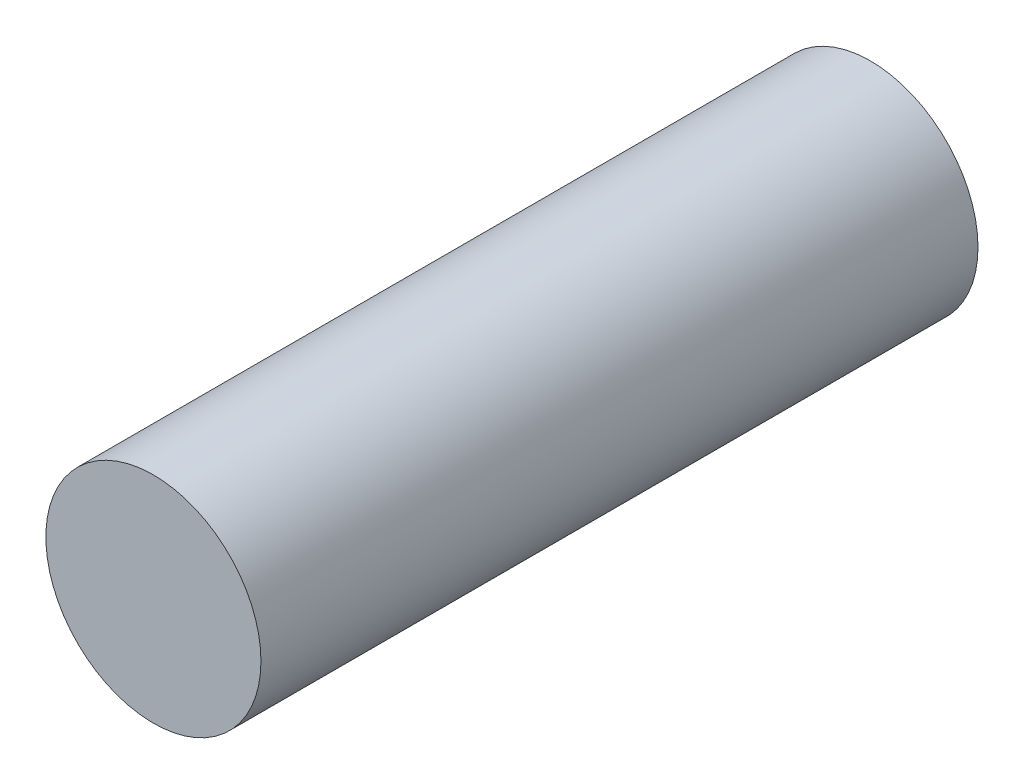
ISO-10303-21;
HEADER;
FILE_DESCRIPTION(('STEP AP214'),'2;1');
FILE_NAME('part.step','',(''),(''),'','','');
FILE_SCHEMA(('AUTOMOTIVE_DESIGN { 1 0 10303 214 1 1 1 1 }'));
ENDSEC;
DATA;
#1=APPLICATION_CONTEXT('core data for automotive mechanical design processes');
#2=APPLICATION_PROTOCOL_DEFINITION('international standard','automotive_design',2000,#1);
#3=PRODUCT_CONTEXT('',#1,'mechanical');
#4=PRODUCT('Part','Part','',(#3));
#5=PRODUCT_RELATED_PRODUCT_CATEGORY('part','',(#4));
#6=PRODUCT_DEFINITION_FORMATION('','',#4);
#7=PRODUCT_DEFINITION_CONTEXT('part definition',#1,'design');
#8=PRODUCT_DEFINITION('design','',#6,#7);
#9=PRODUCT_DEFINITION_SHAPE('','',#8);
#10=(LENGTH_UNIT() NAMED_UNIT(*) SI_UNIT(.MILLI.,.METRE.));
#11=(NAMED_UNIT(*) PLANE_ANGLE_UNIT() SI_UNIT($,.RADIAN.));
#12=(NAMED_UNIT(*) SI_UNIT($,.STERADIAN.) SOLID_ANGLE_UNIT());
#13=UNCERTAINTY_MEASURE_WITH_UNIT(LENGTH_MEASURE(1.E-05),#10,'distance_accuracy_value','');
#14=(GEOMETRIC_REPRESENTATION_CONTEXT(3) GLOBAL_UNCERTAINTY_ASSIGNED_CONTEXT((#13)) GLOBAL_UNIT_ASSIGNED_CONTEXT((#10,
#11,#12)) REPRESENTATION_CONTEXT('',''));
#15=CARTESIAN_POINT('',(0.,0.,0.));
#16=DIRECTION('',(0.,0.,1.));
#17=DIRECTION('',(1.,0.,0.));
#18=AXIS2_PLACEMENT_3D('',#15,#16,#17);
#19=CARTESIAN_POINT('',(129857.722301623,-224046.534343214,149.999999999551));
#20=DIRECTION('',(0.,0.,1.));
#21=DIRECTION('',(1.,0.,0.));
#22=AXIS2_PLACEMENT_3D('',#19,#20,#21);
#23=CYLINDRICAL_SURFACE('',#22,75.0000000000223);
#24=CARTESIAN_POINT('',(129857.722301623,-224046.534343214,149.999999999551));
#25=DIRECTION('',(0.,0.,1.));
#26=DIRECTION('',(1.,0.,0.));
#27=AXIS2_PLACEMENT_3D('',#24,#25,#26);
#28=CIRCLE('',#27,75.0000000000223);
#29=CARTESIAN_POINT('',(129932.722301623,-224046.534343214,149.999999999551));
#30=VERTEX_POINT('',#29);
#31=EDGE_CURVE('E10',#30,#30,#28,.T.);
#32=ORIENTED_EDGE('',*,*,#31,.T.);
#33=EDGE_LOOP('',(#32));
#34=FACE_BOUND('',#33,.T.);
#35=CARTESIAN_POINT('',(129857.722301623,-224046.534343214,649.999999999551));
#36=DIRECTION('',(0.,0.,1.));
#37=DIRECTION('',(1.,0.,0.));
#38=AXIS2_PLACEMENT_3D('',#35,#36,#37);
#39=CIRCLE('',#38,75.0000000000223);
#40=CARTESIAN_POINT('',(129932.722301623,-224046.534343214,649.999999999551));
#41=VERTEX_POINT('',#40);
#42=EDGE_CURVE('E40',#41,#41,#39,.T.);
#43=ORIENTED_EDGE('',*,*,#42,.F.);
#44=EDGE_LOOP('',(#43));
#45=FACE_BOUND('',#44,.T.);
#46=ADVANCED_FACE('F37',(#34,#45),#23,.T.);
#47=CARTESIAN_POINT('',(129857.722301623,-224046.534343214,149.999999999551));
#48=DIRECTION('',(0.,0.,1.));
#49=DIRECTION('',(1.,0.,0.));
#50=AXIS2_PLACEMENT_3D('',#47,#48,#49);
#51=PLANE('',#50);
#52=ORIENTED_EDGE('',*,*,#31,.F.);
#53=EDGE_LOOP('',(#52));
#54=FACE_BOUND('',#53,.T.);
#55=ADVANCED_FACE('F52',(#54),#51,.F.);
#56=CARTESIAN_POINT('',(129857.722301623,-224046.534343214,649.999999999551));
#57=DIRECTION('',(0.,0.,1.));
#58=DIRECTION('',(1.,0.,0.));
#59=AXIS2_PLACEMENT_3D('',#56,#57,#58);
#60=PLANE('',#59);
#61=ORIENTED_EDGE('',*,*,#42,.T.);
#62=EDGE_LOOP('',(#61));
#63=FACE_BOUND('',#62,.T.);
#64=ADVANCED_FACE('F49',(#63),#60,.T.);
#65=CLOSED_SHELL('',(#46,#55,#64));
#66=MANIFOLD_SOLID_BREP('B2',#65);
#67=ADVANCED_BREP_SHAPE_REPRESENTATION('',(#18,#66),#14);
#68=SHAPE_DEFINITION_REPRESENTATION(#9,#67);
ENDSEC;
END-ISO-10303-21;
